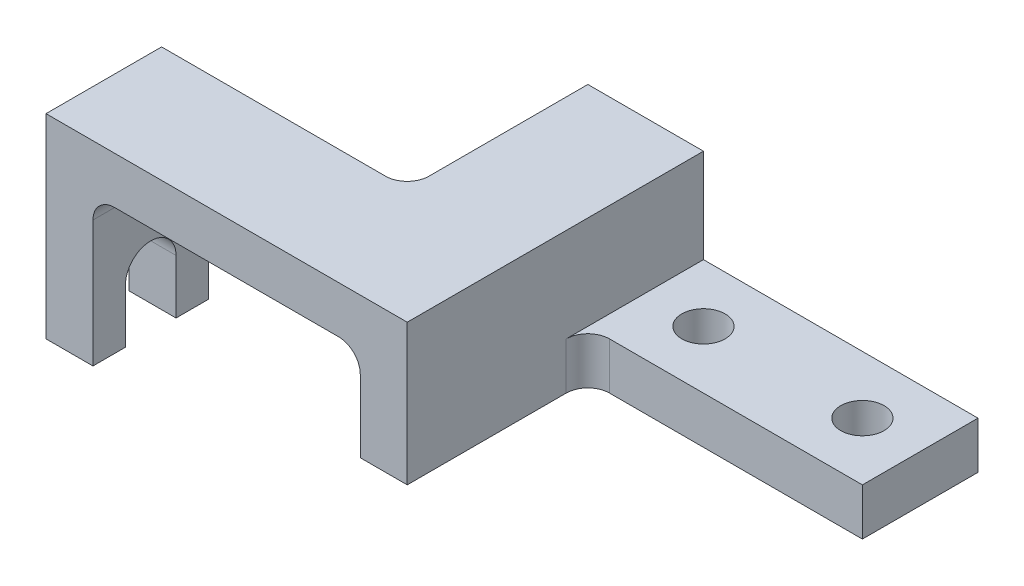
ISO-10303-21;
HEADER;
FILE_DESCRIPTION(('STEP AP214'),'2;1');
FILE_NAME('part.step','',(''),(''),'','','');
FILE_SCHEMA(('AUTOMOTIVE_DESIGN { 1 0 10303 214 1 1 1 1 }'));
ENDSEC;
DATA;
#1=APPLICATION_CONTEXT('core data for automotive mechanical design processes');
#2=APPLICATION_PROTOCOL_DEFINITION('international standard','automotive_design',2000,#1);
#3=PRODUCT_CONTEXT('',#1,'mechanical');
#4=PRODUCT('Part','Part','',(#3));
#5=PRODUCT_RELATED_PRODUCT_CATEGORY('part','',(#4));
#6=PRODUCT_DEFINITION_FORMATION('','',#4);
#7=PRODUCT_DEFINITION_CONTEXT('part definition',#1,'design');
#8=PRODUCT_DEFINITION('design','',#6,#7);
#9=PRODUCT_DEFINITION_SHAPE('','',#8);
#10=(LENGTH_UNIT() NAMED_UNIT(*) SI_UNIT(.MILLI.,.METRE.));
#11=(NAMED_UNIT(*) PLANE_ANGLE_UNIT() SI_UNIT($,.RADIAN.));
#12=(NAMED_UNIT(*) SI_UNIT($,.STERADIAN.) SOLID_ANGLE_UNIT());
#13=UNCERTAINTY_MEASURE_WITH_UNIT(LENGTH_MEASURE(1.E-05),#10,'distance_accuracy_value','');
#14=(GEOMETRIC_REPRESENTATION_CONTEXT(3) GLOBAL_UNCERTAINTY_ASSIGNED_CONTEXT((#13)) GLOBAL_UNIT_ASSIGNED_CONTEXT((#10,
#11,#12)) REPRESENTATION_CONTEXT('',''));
#15=CARTESIAN_POINT('',(0.,0.,0.));
#16=DIRECTION('',(0.,0.,1.));
#17=DIRECTION('',(1.,0.,0.));
#18=AXIS2_PLACEMENT_3D('',#15,#16,#17);
#19=CARTESIAN_POINT('',(0.,0.,0.));
#20=DIRECTION('',(0.,-1.,0.));
#21=DIRECTION('',(0.,0.,-1.));
#22=AXIS2_PLACEMENT_3D('',#19,#20,#21);
#23=PLANE('',#22);
#24=DIRECTION('',(0.,0.,1.));
#25=VECTOR('',#24,1.);
#26=CARTESIAN_POINT('',(0.,0.,0.));
#27=LINE('',#26,#25);
#28=CARTESIAN_POINT('',(0.,0.,-9.));
#29=VERTEX_POINT('',#28);
#30=CARTESIAN_POINT('',(0.,0.,0.));
#31=VERTEX_POINT('',#30);
#32=EDGE_CURVE('E335',#29,#31,#27,.T.);
#33=ORIENTED_EDGE('',*,*,#32,.F.);
#34=DIRECTION('',(-1.,0.,0.));
#35=VECTOR('',#34,1.);
#36=CARTESIAN_POINT('',(176.001,0.,-9.));
#37=LINE('',#36,#35);
#38=CARTESIAN_POINT('',(13.,0.,-8.99999999999999));
#39=VERTEX_POINT('',#38);
#40=EDGE_CURVE('E220',#39,#29,#37,.T.);
#41=ORIENTED_EDGE('',*,*,#40,.F.);
#42=DIRECTION('',(0.,0.,1.));
#43=VECTOR('',#42,1.);
#44=CARTESIAN_POINT('',(13.,0.,-82.));
#45=LINE('',#44,#43);
#46=CARTESIAN_POINT('',(13.,0.,0.));
#47=VERTEX_POINT('',#46);
#48=EDGE_CURVE('E268',#39,#47,#45,.T.);
#49=ORIENTED_EDGE('',*,*,#48,.T.);
#50=DIRECTION('',(1.,0.,0.));
#51=VECTOR('',#50,1.);
#52=CARTESIAN_POINT('',(0.,0.,0.));
#53=LINE('',#52,#51);
#54=EDGE_CURVE('E359',#31,#47,#53,.T.);
#55=ORIENTED_EDGE('',*,*,#54,.F.);
#56=EDGE_LOOP('',(#33,#41,#49,#55));
#57=FACE_BOUND('',#56,.T.);
#58=ADVANCED_FACE('F37',(#57),#23,.T.);
#59=CARTESIAN_POINT('',(13.,0.,-32.));
#60=VERTEX_POINT('',#59);
#61=CARTESIAN_POINT('',(13.,0.,-23.));
#62=VERTEX_POINT('',#61);
#63=EDGE_CURVE('E263',#60,#62,#45,.T.);
#64=ORIENTED_EDGE('',*,*,#63,.T.);
#65=DIRECTION('',(-1.,0.,0.));
#66=VECTOR('',#65,1.);
#67=CARTESIAN_POINT('',(176.001,0.,-23.));
#68=LINE('',#67,#66);
#69=CARTESIAN_POINT('',(0.,0.,-23.));
#70=VERTEX_POINT('',#69);
#71=EDGE_CURVE('E53',#62,#70,#68,.T.);
#72=ORIENTED_EDGE('',*,*,#71,.T.);
#73=CARTESIAN_POINT('',(0.,0.,-32.));
#74=VERTEX_POINT('',#73);
#75=EDGE_CURVE('E205',#74,#70,#27,.T.);
#76=ORIENTED_EDGE('',*,*,#75,.F.);
#77=DIRECTION('',(-1.,0.,0.));
#78=VECTOR('',#77,1.);
#79=CARTESIAN_POINT('',(0.,0.,-32.));
#80=LINE('',#79,#78);
#81=EDGE_CURVE('E341',#60,#74,#80,.T.);
#82=ORIENTED_EDGE('',*,*,#81,.F.);
#83=EDGE_LOOP('',(#64,#72,#76,#82));
#84=FACE_BOUND('',#83,.T.);
#85=ADVANCED_FACE('F437',(#84),#23,.T.);
#86=CARTESIAN_POINT('',(0.,54.,0.));
#87=DIRECTION('',(1.,0.,0.));
#88=DIRECTION('',(0.,0.,-1.));
#89=AXIS2_PLACEMENT_3D('',#86,#87,#88);
#90=PLANE('',#89);
#91=DIRECTION('',(0.,-1.,0.));
#92=VECTOR('',#91,1.);
#93=CARTESIAN_POINT('',(0.,15.,-9.));
#94=LINE('',#93,#92);
#95=CARTESIAN_POINT('',(0.,15.,-9.));
#96=VERTEX_POINT('',#95);
#97=EDGE_CURVE('E218',#96,#29,#94,.T.);
#98=ORIENTED_EDGE('',*,*,#97,.T.);
#99=ORIENTED_EDGE('',*,*,#32,.T.);
#100=DIRECTION('',(0.,-1.,0.));
#101=VECTOR('',#100,1.);
#102=CARTESIAN_POINT('',(0.,54.,0.));
#103=LINE('',#102,#101);
#104=CARTESIAN_POINT('',(0.,54.,0.));
#105=VERTEX_POINT('',#104);
#106=EDGE_CURVE('E382',#105,#31,#103,.T.);
#107=ORIENTED_EDGE('',*,*,#106,.F.);
#108=DIRECTION('',(0.,0.,1.));
#109=VECTOR('',#108,1.);
#110=CARTESIAN_POINT('',(0.,54.,0.));
#111=LINE('',#110,#109);
#112=CARTESIAN_POINT('',(0.,54.,-32.));
#113=VERTEX_POINT('',#112);
#114=EDGE_CURVE('E336',#113,#105,#111,.T.);
#115=ORIENTED_EDGE('',*,*,#114,.F.);
#116=DIRECTION('',(0.,-1.,0.));
#117=VECTOR('',#116,1.);
#118=CARTESIAN_POINT('',(0.,54.,-32.));
#119=LINE('',#118,#117);
#120=EDGE_CURVE('E356',#113,#74,#119,.T.);
#121=ORIENTED_EDGE('',*,*,#120,.T.);
#122=ORIENTED_EDGE('',*,*,#75,.T.);
#123=DIRECTION('',(0.,1.,0.));
#124=VECTOR('',#123,1.);
#125=CARTESIAN_POINT('',(0.,15.,-23.));
#126=LINE('',#125,#124);
#127=CARTESIAN_POINT('',(0.,15.,-23.));
#128=VERTEX_POINT('',#127);
#129=EDGE_CURVE('E183',#70,#128,#126,.T.);
#130=ORIENTED_EDGE('',*,*,#129,.T.);
#131=CARTESIAN_POINT('',(0.,15.,-16.));
#132=DIRECTION('',(1.,0.,0.));
#133=DIRECTION('',(0.,0.,-1.));
#134=AXIS2_PLACEMENT_3D('',#131,#132,#133);
#135=CIRCLE('',#134,7.);
#136=EDGE_CURVE('E188',#128,#96,#135,.T.);
#137=ORIENTED_EDGE('',*,*,#136,.T.);
#138=EDGE_LOOP('',(#98,#99,#107,#115,#121,#122,#130,#137));
#139=FACE_BOUND('',#138,.T.);
#140=ADVANCED_FACE('F202',(#139),#90,.F.);
#141=CARTESIAN_POINT('',(13.,35.,-82.));
#142=DIRECTION('',(-1.,0.,0.));
#143=DIRECTION('',(0.,0.,1.));
#144=AXIS2_PLACEMENT_3D('',#141,#142,#143);
#145=PLANE('',#144);
#146=DIRECTION('',(0.,1.,0.));
#147=VECTOR('',#146,1.);
#148=CARTESIAN_POINT('',(13.,15.,-9.));
#149=LINE('',#148,#147);
#150=CARTESIAN_POINT('',(13.,15.,-9.));
#151=VERTEX_POINT('',#150);
#152=EDGE_CURVE('E199',#39,#151,#149,.T.);
#153=ORIENTED_EDGE('',*,*,#152,.T.);
#154=CARTESIAN_POINT('',(13.,15.,-16.));
#155=DIRECTION('',(-1.,0.,0.));
#156=DIRECTION('',(0.,0.,1.));
#157=AXIS2_PLACEMENT_3D('',#154,#155,#156);
#158=CIRCLE('',#157,7.);
#159=CARTESIAN_POINT('',(13.,15.,-23.));
#160=VERTEX_POINT('',#159);
#161=EDGE_CURVE('E189',#151,#160,#158,.T.);
#162=ORIENTED_EDGE('',*,*,#161,.T.);
#163=DIRECTION('',(0.,-1.,0.));
#164=VECTOR('',#163,1.);
#165=CARTESIAN_POINT('',(13.,15.,-23.));
#166=LINE('',#165,#164);
#167=EDGE_CURVE('E184',#160,#62,#166,.T.);
#168=ORIENTED_EDGE('',*,*,#167,.T.);
#169=ORIENTED_EDGE('',*,*,#63,.F.);
#170=DIRECTION('',(0.,-1.,0.));
#171=VECTOR('',#170,1.);
#172=CARTESIAN_POINT('',(13.,54.,-32.));
#173=LINE('',#172,#171);
#174=CARTESIAN_POINT('',(13.,35.,-32.));
#175=VERTEX_POINT('',#174);
#176=EDGE_CURVE('E11',#175,#60,#173,.T.);
#177=ORIENTED_EDGE('',*,*,#176,.F.);
#178=DIRECTION('',(0.,0.,1.));
#179=VECTOR('',#178,1.);
#180=CARTESIAN_POINT('',(13.,35.,-82.));
#181=LINE('',#180,#179);
#182=CARTESIAN_POINT('',(13.,35.,0.));
#183=VERTEX_POINT('',#182);
#184=EDGE_CURVE('E269',#175,#183,#181,.T.);
#185=ORIENTED_EDGE('',*,*,#184,.T.);
#186=DIRECTION('',(0.,-1.,0.));
#187=VECTOR('',#186,1.);
#188=CARTESIAN_POINT('',(13.,35.,0.));
#189=LINE('',#188,#187);
#190=EDGE_CURVE('E232',#183,#47,#189,.T.);
#191=ORIENTED_EDGE('',*,*,#190,.T.);
#192=ORIENTED_EDGE('',*,*,#48,.F.);
#193=EDGE_LOOP('',(#153,#162,#168,#169,#177,#185,#191,#192));
#194=FACE_BOUND('',#193,.T.);
#195=ADVANCED_FACE('F435',(#194),#145,.F.);
#196=CARTESIAN_POINT('',(0.,54.,0.));
#197=DIRECTION('',(0.,-1.,0.));
#198=DIRECTION('',(0.,0.,-1.));
#199=AXIS2_PLACEMENT_3D('',#196,#197,#198);
#200=PLANE('',#199);
#201=DIRECTION('',(0.,0.,-1.));
#202=VECTOR('',#201,1.);
#203=CARTESIAN_POINT('',(100.,54.,0.));
#204=LINE('',#203,#202);
#205=CARTESIAN_POINT('',(100.,54.,0.));
#206=VERTEX_POINT('',#205);
#207=CARTESIAN_POINT('',(100.,54.,-82.));
#208=VERTEX_POINT('',#207);
#209=EDGE_CURVE('E344',#206,#208,#204,.T.);
#210=ORIENTED_EDGE('',*,*,#209,.T.);
#211=DIRECTION('',(-1.,0.,0.));
#212=VECTOR('',#211,1.);
#213=CARTESIAN_POINT('',(68.,54.,-82.));
#214=LINE('',#213,#212);
#215=CARTESIAN_POINT('',(68.,54.,-82.));
#216=VERTEX_POINT('',#215);
#217=EDGE_CURVE('E347',#208,#216,#214,.T.);
#218=ORIENTED_EDGE('',*,*,#217,.T.);
#219=DIRECTION('',(0.,0.,1.));
#220=VECTOR('',#219,1.);
#221=CARTESIAN_POINT('',(68.,54.,-32.));
#222=LINE('',#221,#220);
#223=CARTESIAN_POINT('',(68.,54.,-38.));
#224=VERTEX_POINT('',#223);
#225=EDGE_CURVE('E350',#216,#224,#222,.T.);
#226=ORIENTED_EDGE('',*,*,#225,.T.);
#227=CARTESIAN_POINT('',(62.,54.,-38.));
#228=DIRECTION('',(0.,-1.,0.));
#229=DIRECTION('',(0.,0.,-1.));
#230=AXIS2_PLACEMENT_3D('',#227,#228,#229);
#231=CIRCLE('',#230,6.);
#232=CARTESIAN_POINT('',(62.,54.,-32.));
#233=VERTEX_POINT('',#232);
#234=EDGE_CURVE('E401',#224,#233,#231,.T.);
#235=ORIENTED_EDGE('',*,*,#234,.T.);
#236=DIRECTION('',(-1.,0.,0.));
#237=VECTOR('',#236,1.);
#238=CARTESIAN_POINT('',(0.,54.,-32.));
#239=LINE('',#238,#237);
#240=EDGE_CURVE('E354',#233,#113,#239,.T.);
#241=ORIENTED_EDGE('',*,*,#240,.T.);
#242=ORIENTED_EDGE('',*,*,#114,.T.);
#243=DIRECTION('',(1.,0.,0.));
#244=VECTOR('',#243,1.);
#245=CARTESIAN_POINT('',(0.,54.,0.));
#246=LINE('',#245,#244);
#247=EDGE_CURVE('E340',#105,#206,#246,.T.);
#248=ORIENTED_EDGE('',*,*,#247,.T.);
#249=EDGE_LOOP('',(#210,#218,#226,#235,#241,#242,#248));
#250=FACE_BOUND('',#249,.T.);
#251=ADVANCED_FACE('F443',(#250),#200,.F.);
#252=CARTESIAN_POINT('',(0.,54.,0.));
#253=DIRECTION('',(0.,0.,-1.));
#254=DIRECTION('',(-1.,0.,0.));
#255=AXIS2_PLACEMENT_3D('',#252,#253,#254);
#256=PLANE('',#255);
#257=ORIENTED_EDGE('',*,*,#54,.T.);
#258=ORIENTED_EDGE('',*,*,#190,.F.);
#259=CARTESIAN_POINT('',(19.,35.,0.));
#260=DIRECTION('',(0.,0.,1.));
#261=DIRECTION('',(-1.,0.,0.));
#262=AXIS2_PLACEMENT_3D('',#259,#260,#261);
#263=CIRCLE('',#262,6.);
#264=CARTESIAN_POINT('',(19.,41.,0.));
#265=VERTEX_POINT('',#264);
#266=EDGE_CURVE('E256',#265,#183,#263,.T.);
#267=ORIENTED_EDGE('',*,*,#266,.F.);
#268=DIRECTION('',(-1.,0.,0.));
#269=VECTOR('',#268,1.);
#270=CARTESIAN_POINT('',(19.,41.,0.));
#271=LINE('',#270,#269);
#272=CARTESIAN_POINT('',(80.9999999999999,41.,0.));
#273=VERTEX_POINT('',#272);
#274=EDGE_CURVE('E252',#273,#265,#271,.T.);
#275=ORIENTED_EDGE('',*,*,#274,.F.);
#276=CARTESIAN_POINT('',(81.,35.,0.));
#277=DIRECTION('',(0.,0.,1.));
#278=DIRECTION('',(1.,0.,0.));
#279=AXIS2_PLACEMENT_3D('',#276,#277,#278);
#280=CIRCLE('',#279,6.);
#281=CARTESIAN_POINT('',(87.,35.,0.));
#282=VERTEX_POINT('',#281);
#283=EDGE_CURVE('E248',#282,#273,#280,.T.);
#284=ORIENTED_EDGE('',*,*,#283,.F.);
#285=DIRECTION('',(0.,1.,0.));
#286=VECTOR('',#285,1.);
#287=CARTESIAN_POINT('',(87.,35.,0.));
#288=LINE('',#287,#286);
#289=CARTESIAN_POINT('',(87.,15.,0.));
#290=VERTEX_POINT('',#289);
#291=EDGE_CURVE('E212',#290,#282,#288,.T.);
#292=ORIENTED_EDGE('',*,*,#291,.F.);
#293=DIRECTION('',(-1.,0.,0.));
#294=VECTOR('',#293,1.);
#295=CARTESIAN_POINT('',(87.,15.,0.));
#296=LINE('',#295,#294);
#297=CARTESIAN_POINT('',(100.,15.,0.));
#298=VERTEX_POINT('',#297);
#299=EDGE_CURVE('E207',#298,#290,#296,.T.);
#300=ORIENTED_EDGE('',*,*,#299,.F.);
#301=DIRECTION('',(0.,-1.,0.));
#302=VECTOR('',#301,1.);
#303=CARTESIAN_POINT('',(100.,54.,0.));
#304=LINE('',#303,#302);
#305=EDGE_CURVE('E379',#206,#298,#304,.T.);
#306=ORIENTED_EDGE('',*,*,#305,.F.);
#307=ORIENTED_EDGE('',*,*,#247,.F.);
#308=ORIENTED_EDGE('',*,*,#106,.T.);
#309=EDGE_LOOP('',(#257,#258,#267,#275,#284,#292,#300,#306,#307,#308));
#310=FACE_BOUND('',#309,.T.);
#311=ADVANCED_FACE('F431',(#310),#256,.F.);
#312=CARTESIAN_POINT('',(100.,54.,0.));
#313=DIRECTION('',(-1.,0.,0.));
#314=DIRECTION('',(0.,0.,1.));
#315=AXIS2_PLACEMENT_3D('',#312,#313,#314);
#316=PLANE('',#315);
#317=ORIENTED_EDGE('',*,*,#305,.T.);
#318=DIRECTION('',(0.,0.,-1.));
#319=VECTOR('',#318,1.);
#320=CARTESIAN_POINT('',(100.,15.,0.));
#321=LINE('',#320,#319);
#322=CARTESIAN_POINT('',(100.,15.,-44.));
#323=VERTEX_POINT('',#322);
#324=EDGE_CURVE('E323',#298,#323,#321,.T.);
#325=ORIENTED_EDGE('',*,*,#324,.T.);
#326=DIRECTION('',(0.,-1.,0.));
#327=VECTOR('',#326,1.);
#328=CARTESIAN_POINT('',(100.,54.,-44.));
#329=LINE('',#328,#327);
#330=CARTESIAN_POINT('',(100.,28.,-44.));
#331=VERTEX_POINT('',#330);
#332=EDGE_CURVE('E390',#323,#331,#329,.F.);
#333=ORIENTED_EDGE('',*,*,#332,.T.);
#334=DIRECTION('',(0.,0.,1.));
#335=VECTOR('',#334,1.);
#336=CARTESIAN_POINT('',(100.,28.,-82.));
#337=LINE('',#336,#335);
#338=CARTESIAN_POINT('',(100.,28.,-82.));
#339=VERTEX_POINT('',#338);
#340=EDGE_CURVE('E61',#339,#331,#337,.T.);
#341=ORIENTED_EDGE('',*,*,#340,.F.);
#342=DIRECTION('',(0.,-1.,0.));
#343=VECTOR('',#342,1.);
#344=CARTESIAN_POINT('',(100.,54.,-82.));
#345=LINE('',#344,#343);
#346=EDGE_CURVE('E267',#208,#339,#345,.T.);
#347=ORIENTED_EDGE('',*,*,#346,.F.);
#348=ORIENTED_EDGE('',*,*,#209,.F.);
#349=EDGE_LOOP('',(#317,#325,#333,#341,#347,#348));
#350=FACE_BOUND('',#349,.T.);
#351=ADVANCED_FACE('F470',(#350),#316,.F.);
#352=CARTESIAN_POINT('',(100.,54.,-50.));
#353=DIRECTION('',(0.,0.,-1.));
#354=DIRECTION('',(-1.,0.,0.));
#355=AXIS2_PLACEMENT_3D('',#352,#353,#354);
#356=PLANE('',#355);
#357=DIRECTION('',(0.,-1.,0.));
#358=VECTOR('',#357,1.);
#359=CARTESIAN_POINT('',(106.,0.,-50.));
#360=LINE('',#359,#358);
#361=CARTESIAN_POINT('',(106.,28.,-50.));
#362=VERTEX_POINT('',#361);
#363=CARTESIAN_POINT('',(106.,15.,-50.));
#364=VERTEX_POINT('',#363);
#365=EDGE_CURVE('E386',#362,#364,#360,.T.);
#366=ORIENTED_EDGE('',*,*,#365,.T.);
#367=DIRECTION('',(1.,0.,0.));
#368=VECTOR('',#367,1.);
#369=CARTESIAN_POINT('',(100.,15.,-50.));
#370=LINE('',#369,#368);
#371=CARTESIAN_POINT('',(176.,15.,-50.));
#372=VERTEX_POINT('',#371);
#373=EDGE_CURVE('E319',#364,#372,#370,.T.);
#374=ORIENTED_EDGE('',*,*,#373,.T.);
#375=DIRECTION('',(0.,-1.,0.));
#376=VECTOR('',#375,1.);
#377=CARTESIAN_POINT('',(176.,54.,-50.));
#378=LINE('',#377,#376);
#379=CARTESIAN_POINT('',(176.,28.,-50.));
#380=VERTEX_POINT('',#379);
#381=EDGE_CURVE('E375',#380,#372,#378,.T.);
#382=ORIENTED_EDGE('',*,*,#381,.F.);
#383=DIRECTION('',(-1.,0.,0.));
#384=VECTOR('',#383,1.);
#385=CARTESIAN_POINT('',(100.,28.,-50.));
#386=LINE('',#385,#384);
#387=EDGE_CURVE('E308',#380,#362,#386,.T.);
#388=ORIENTED_EDGE('',*,*,#387,.T.);
#389=EDGE_LOOP('',(#366,#374,#382,#388));
#390=FACE_BOUND('',#389,.T.);
#391=ADVANCED_FACE('F478',(#390),#356,.F.);
#392=CARTESIAN_POINT('',(176.,54.,-50.));
#393=DIRECTION('',(-1.,0.,0.));
#394=DIRECTION('',(0.,0.,1.));
#395=AXIS2_PLACEMENT_3D('',#392,#393,#394);
#396=PLANE('',#395);
#397=ORIENTED_EDGE('',*,*,#381,.T.);
#398=DIRECTION('',(0.,0.,1.));
#399=VECTOR('',#398,1.);
#400=CARTESIAN_POINT('',(176.,15.,-82.));
#401=LINE('',#400,#399);
#402=CARTESIAN_POINT('',(176.,15.,-82.));
#403=VERTEX_POINT('',#402);
#404=EDGE_CURVE('E243',#403,#372,#401,.T.);
#405=ORIENTED_EDGE('',*,*,#404,.F.);
#406=DIRECTION('',(0.,-1.,0.));
#407=VECTOR('',#406,1.);
#408=CARTESIAN_POINT('',(176.,54.,-82.));
#409=LINE('',#408,#407);
#410=CARTESIAN_POINT('',(176.,28.,-82.));
#411=VERTEX_POINT('',#410);
#412=EDGE_CURVE('E371',#411,#403,#409,.T.);
#413=ORIENTED_EDGE('',*,*,#412,.F.);
#414=DIRECTION('',(0.,0.,1.));
#415=VECTOR('',#414,1.);
#416=CARTESIAN_POINT('',(176.,28.,-82.));
#417=LINE('',#416,#415);
#418=EDGE_CURVE('E294',#411,#380,#417,.T.);
#419=ORIENTED_EDGE('',*,*,#418,.T.);
#420=EDGE_LOOP('',(#397,#405,#413,#419));
#421=FACE_BOUND('',#420,.T.);
#422=ADVANCED_FACE('F480',(#421),#396,.F.);
#423=CARTESIAN_POINT('',(68.,54.,-82.));
#424=DIRECTION('',(0.,0.,1.));
#425=DIRECTION('',(1.,0.,0.));
#426=AXIS2_PLACEMENT_3D('',#423,#424,#425);
#427=PLANE('',#426);
#428=CARTESIAN_POINT('',(81.,35.,-82.));
#429=DIRECTION('',(0.,0.,1.));
#430=DIRECTION('',(1.,0.,0.));
#431=AXIS2_PLACEMENT_3D('',#428,#429,#430);
#432=CIRCLE('',#431,6.);
#433=CARTESIAN_POINT('',(87.,35.,-82.));
#434=VERTEX_POINT('',#433);
#435=CARTESIAN_POINT('',(80.9999999999999,41.,-82.));
#436=VERTEX_POINT('',#435);
#437=EDGE_CURVE('E236',#434,#436,#432,.T.);
#438=ORIENTED_EDGE('',*,*,#437,.T.);
#439=DIRECTION('',(-1.,0.,0.));
#440=VECTOR('',#439,1.);
#441=CARTESIAN_POINT('',(19.,41.,-82.));
#442=LINE('',#441,#440);
#443=CARTESIAN_POINT('',(68.,41.,-82.));
#444=VERTEX_POINT('',#443);
#445=EDGE_CURVE('E240',#436,#444,#442,.T.);
#446=ORIENTED_EDGE('',*,*,#445,.T.);
#447=DIRECTION('',(0.,-1.,0.));
#448=VECTOR('',#447,1.);
#449=CARTESIAN_POINT('',(68.,54.,-82.));
#450=LINE('',#449,#448);
#451=EDGE_CURVE('E367',#216,#444,#450,.T.);
#452=ORIENTED_EDGE('',*,*,#451,.F.);
#453=ORIENTED_EDGE('',*,*,#217,.F.);
#454=ORIENTED_EDGE('',*,*,#346,.T.);
#455=DIRECTION('',(1.,0.,0.));
#456=VECTOR('',#455,1.);
#457=CARTESIAN_POINT('',(100.,28.,-82.));
#458=LINE('',#457,#456);
#459=EDGE_CURVE('E290',#339,#411,#458,.T.);
#460=ORIENTED_EDGE('',*,*,#459,.T.);
#461=ORIENTED_EDGE('',*,*,#412,.T.);
#462=DIRECTION('',(-1.,0.,0.));
#463=VECTOR('',#462,1.);
#464=CARTESIAN_POINT('',(87.,15.,-82.));
#465=LINE('',#464,#463);
#466=CARTESIAN_POINT('',(87.,15.,-82.));
#467=VERTEX_POINT('',#466);
#468=EDGE_CURVE('E227',#403,#467,#465,.T.);
#469=ORIENTED_EDGE('',*,*,#468,.T.);
#470=DIRECTION('',(0.,1.,0.));
#471=VECTOR('',#470,1.);
#472=CARTESIAN_POINT('',(87.,35.,-82.));
#473=LINE('',#472,#471);
#474=EDGE_CURVE('E231',#467,#434,#473,.T.);
#475=ORIENTED_EDGE('',*,*,#474,.T.);
#476=EDGE_LOOP('',(#438,#446,#452,#453,#454,#460,#461,#469,#475));
#477=FACE_BOUND('',#476,.T.);
#478=ADVANCED_FACE('F455',(#477),#427,.F.);
#479=CARTESIAN_POINT('',(68.,54.,-32.));
#480=DIRECTION('',(1.,0.,0.));
#481=DIRECTION('',(0.,0.,-1.));
#482=AXIS2_PLACEMENT_3D('',#479,#480,#481);
#483=PLANE('',#482);
#484=ORIENTED_EDGE('',*,*,#451,.T.);
#485=DIRECTION('',(0.,0.,1.));
#486=VECTOR('',#485,1.);
#487=CARTESIAN_POINT('',(68.,41.,-32.));
#488=LINE('',#487,#486);
#489=CARTESIAN_POINT('',(68.,41.,-38.));
#490=VERTEX_POINT('',#489);
#491=EDGE_CURVE('E304',#444,#490,#488,.T.);
#492=ORIENTED_EDGE('',*,*,#491,.T.);
#493=DIRECTION('',(0.,-1.,0.));
#494=VECTOR('',#493,1.);
#495=CARTESIAN_POINT('',(68.,54.,-38.));
#496=LINE('',#495,#494);
#497=EDGE_CURVE('E398',#490,#224,#496,.F.);
#498=ORIENTED_EDGE('',*,*,#497,.T.);
#499=ORIENTED_EDGE('',*,*,#225,.F.);
#500=EDGE_LOOP('',(#484,#492,#498,#499));
#501=FACE_BOUND('',#500,.T.);
#502=ADVANCED_FACE('F450',(#501),#483,.F.);
#503=CARTESIAN_POINT('',(0.,54.,-32.));
#504=DIRECTION('',(0.,0.,1.));
#505=DIRECTION('',(1.,0.,0.));
#506=AXIS2_PLACEMENT_3D('',#503,#504,#505);
#507=PLANE('',#506);
#508=CARTESIAN_POINT('',(19.,35.,-32.));
#509=DIRECTION('',(0.,0.,1.));
#510=DIRECTION('',(1.,0.,0.));
#511=AXIS2_PLACEMENT_3D('',#508,#509,#510);
#512=CIRCLE('',#511,6.);
#513=CARTESIAN_POINT('',(19.,41.,-32.));
#514=VERTEX_POINT('',#513);
#515=EDGE_CURVE('E46',#514,#175,#512,.T.);
#516=ORIENTED_EDGE('',*,*,#515,.T.);
#517=ORIENTED_EDGE('',*,*,#176,.T.);
#518=ORIENTED_EDGE('',*,*,#81,.T.);
#519=ORIENTED_EDGE('',*,*,#120,.F.);
#520=ORIENTED_EDGE('',*,*,#240,.F.);
#521=DIRECTION('',(0.,-1.,0.));
#522=VECTOR('',#521,1.);
#523=CARTESIAN_POINT('',(62.,0.,-32.));
#524=LINE('',#523,#522);
#525=CARTESIAN_POINT('',(62.,41.,-32.));
#526=VERTEX_POINT('',#525);
#527=EDGE_CURVE('E394',#233,#526,#524,.T.);
#528=ORIENTED_EDGE('',*,*,#527,.T.);
#529=DIRECTION('',(-1.,0.,0.));
#530=VECTOR('',#529,1.);
#531=CARTESIAN_POINT('',(0.,41.,-32.));
#532=LINE('',#531,#530);
#533=EDGE_CURVE('E298',#526,#514,#532,.T.);
#534=ORIENTED_EDGE('',*,*,#533,.T.);
#535=EDGE_LOOP('',(#516,#517,#518,#519,#520,#528,#534));
#536=FACE_BOUND('',#535,.T.);
#537=ADVANCED_FACE('F417',(#536),#507,.F.);
#538=CARTESIAN_POINT('',(106.,54.,-44.));
#539=DIRECTION('',(0.,1.,0.));
#540=DIRECTION('',(0.,0.,1.));
#541=AXIS2_PLACEMENT_3D('',#538,#539,#540);
#542=CYLINDRICAL_SURFACE('',#541,6.);
#543=ORIENTED_EDGE('',*,*,#332,.F.);
#544=CARTESIAN_POINT('',(106.,15.,-44.));
#545=DIRECTION('',(0.,1.,0.));
#546=DIRECTION('',(0.,0.,1.));
#547=AXIS2_PLACEMENT_3D('',#544,#545,#546);
#548=CIRCLE('',#547,6.);
#549=EDGE_CURVE('E411',#323,#364,#548,.F.);
#550=ORIENTED_EDGE('',*,*,#549,.T.);
#551=ORIENTED_EDGE('',*,*,#365,.F.);
#552=CARTESIAN_POINT('',(106.,28.,-44.));
#553=DIRECTION('',(0.,-1.,0.));
#554=DIRECTION('',(0.,0.,-1.));
#555=AXIS2_PLACEMENT_3D('',#552,#553,#554);
#556=CIRCLE('',#555,6.);
#557=EDGE_CURVE('E408',#362,#331,#556,.F.);
#558=ORIENTED_EDGE('',*,*,#557,.T.);
#559=EDGE_LOOP('',(#543,#550,#551,#558));
#560=FACE_BOUND('',#559,.T.);
#561=ADVANCED_FACE('F473',(#560),#542,.F.);
#562=CARTESIAN_POINT('',(62.,54.,-38.));
#563=DIRECTION('',(0.,1.,0.));
#564=DIRECTION('',(0.,0.,1.));
#565=AXIS2_PLACEMENT_3D('',#562,#563,#564);
#566=CYLINDRICAL_SURFACE('',#565,6.);
#567=ORIENTED_EDGE('',*,*,#497,.F.);
#568=CARTESIAN_POINT('',(62.,41.,-38.));
#569=DIRECTION('',(0.,1.,0.));
#570=DIRECTION('',(0.,0.,1.));
#571=AXIS2_PLACEMENT_3D('',#568,#569,#570);
#572=CIRCLE('',#571,6.);
#573=EDGE_CURVE('E404',#490,#526,#572,.F.);
#574=ORIENTED_EDGE('',*,*,#573,.T.);
#575=ORIENTED_EDGE('',*,*,#527,.F.);
#576=ORIENTED_EDGE('',*,*,#234,.F.);
#577=EDGE_LOOP('',(#567,#574,#575,#576));
#578=FACE_BOUND('',#577,.T.);
#579=ADVANCED_FACE('F39',(#578),#566,.F.);
#580=CARTESIAN_POINT('',(19.,35.,-82.));
#581=DIRECTION('',(0.,0.,1.));
#582=DIRECTION('',(1.,0.,0.));
#583=AXIS2_PLACEMENT_3D('',#580,#581,#582);
#584=CYLINDRICAL_SURFACE('',#583,6.);
#585=DIRECTION('',(0.,0.,1.));
#586=VECTOR('',#585,1.);
#587=CARTESIAN_POINT('',(19.,41.,-82.));
#588=LINE('',#587,#586);
#589=EDGE_CURVE('E272',#514,#265,#588,.T.);
#590=ORIENTED_EDGE('',*,*,#589,.T.);
#591=ORIENTED_EDGE('',*,*,#266,.T.);
#592=ORIENTED_EDGE('',*,*,#184,.F.);
#593=ORIENTED_EDGE('',*,*,#515,.F.);
#594=EDGE_LOOP('',(#590,#591,#592,#593));
#595=FACE_BOUND('',#594,.T.);
#596=ADVANCED_FACE('F422',(#595),#584,.F.);
#597=CARTESIAN_POINT('',(87.,15.,-82.));
#598=DIRECTION('',(0.,1.,0.));
#599=DIRECTION('',(0.,0.,1.));
#600=AXIS2_PLACEMENT_3D('',#597,#598,#599);
#601=PLANE('',#600);
#602=CARTESIAN_POINT('',(116.,15.,-66.));
#603=DIRECTION('',(0.,1.,0.));
#604=DIRECTION('',(0.,0.,1.));
#605=AXIS2_PLACEMENT_3D('',#602,#603,#604);
#606=CIRCLE('',#605,6.);
#607=CARTESIAN_POINT('',(116.,15.,-60.));
#608=VERTEX_POINT('',#607);
#609=EDGE_CURVE('E331',#608,#608,#606,.T.);
#610=ORIENTED_EDGE('',*,*,#609,.T.);
#611=EDGE_LOOP('',(#610));
#612=FACE_BOUND('',#611,.T.);
#613=CARTESIAN_POINT('',(160.,15.,-66.));
#614=DIRECTION('',(0.,1.,0.));
#615=DIRECTION('',(0.,0.,1.));
#616=AXIS2_PLACEMENT_3D('',#613,#614,#615);
#617=CIRCLE('',#616,6.00000000000002);
#618=CARTESIAN_POINT('',(160.,15.,-60.));
#619=VERTEX_POINT('',#618);
#620=EDGE_CURVE('E327',#619,#619,#617,.T.);
#621=ORIENTED_EDGE('',*,*,#620,.T.);
#622=EDGE_LOOP('',(#621));
#623=FACE_BOUND('',#622,.T.);
#624=ORIENTED_EDGE('',*,*,#299,.T.);
#625=DIRECTION('',(0.,0.,1.));
#626=VECTOR('',#625,1.);
#627=CARTESIAN_POINT('',(87.,15.,-82.));
#628=LINE('',#627,#626);
#629=EDGE_CURVE('E281',#467,#290,#628,.T.);
#630=ORIENTED_EDGE('',*,*,#629,.F.);
#631=ORIENTED_EDGE('',*,*,#468,.F.);
#632=ORIENTED_EDGE('',*,*,#404,.T.);
#633=ORIENTED_EDGE('',*,*,#373,.F.);
#634=ORIENTED_EDGE('',*,*,#549,.F.);
#635=ORIENTED_EDGE('',*,*,#324,.F.);
#636=EDGE_LOOP('',(#624,#630,#631,#632,#633,#634,#635));
#637=FACE_BOUND('',#636,.T.);
#638=ADVANCED_FACE('F465',(#612,#623,#637),#601,.F.);
#639=CARTESIAN_POINT('',(19.,41.,-82.));
#640=DIRECTION('',(0.,1.,0.));
#641=DIRECTION('',(0.,0.,1.));
#642=AXIS2_PLACEMENT_3D('',#639,#640,#641);
#643=PLANE('',#642);
#644=ORIENTED_EDGE('',*,*,#445,.F.);
#645=DIRECTION('',(0.,0.,1.));
#646=VECTOR('',#645,1.);
#647=CARTESIAN_POINT('',(80.9999999999999,41.,-82.));
#648=LINE('',#647,#646);
#649=EDGE_CURVE('E275',#436,#273,#648,.T.);
#650=ORIENTED_EDGE('',*,*,#649,.T.);
#651=ORIENTED_EDGE('',*,*,#274,.T.);
#652=ORIENTED_EDGE('',*,*,#589,.F.);
#653=ORIENTED_EDGE('',*,*,#533,.F.);
#654=ORIENTED_EDGE('',*,*,#573,.F.);
#655=ORIENTED_EDGE('',*,*,#491,.F.);
#656=EDGE_LOOP('',(#644,#650,#651,#652,#653,#654,#655));
#657=FACE_BOUND('',#656,.T.);
#658=ADVANCED_FACE('F425',(#657),#643,.F.);
#659=CARTESIAN_POINT('',(81.,35.,-82.));
#660=DIRECTION('',(0.,0.,1.));
#661=DIRECTION('',(1.,0.,0.));
#662=AXIS2_PLACEMENT_3D('',#659,#660,#661);
#663=CYLINDRICAL_SURFACE('',#662,6.);
#664=ORIENTED_EDGE('',*,*,#283,.T.);
#665=ORIENTED_EDGE('',*,*,#649,.F.);
#666=ORIENTED_EDGE('',*,*,#437,.F.);
#667=DIRECTION('',(0.,0.,1.));
#668=VECTOR('',#667,1.);
#669=CARTESIAN_POINT('',(87.,35.,-82.));
#670=LINE('',#669,#668);
#671=EDGE_CURVE('E278',#434,#282,#670,.T.);
#672=ORIENTED_EDGE('',*,*,#671,.T.);
#673=EDGE_LOOP('',(#664,#665,#666,#672));
#674=FACE_BOUND('',#673,.T.);
#675=ADVANCED_FACE('F459',(#674),#663,.F.);
#676=CARTESIAN_POINT('',(87.,35.,-82.));
#677=DIRECTION('',(1.,0.,0.));
#678=DIRECTION('',(0.,0.,-1.));
#679=AXIS2_PLACEMENT_3D('',#676,#677,#678);
#680=PLANE('',#679);
#681=ORIENTED_EDGE('',*,*,#291,.T.);
#682=ORIENTED_EDGE('',*,*,#671,.F.);
#683=ORIENTED_EDGE('',*,*,#474,.F.);
#684=ORIENTED_EDGE('',*,*,#629,.T.);
#685=EDGE_LOOP('',(#681,#682,#683,#684));
#686=FACE_BOUND('',#685,.T.);
#687=ADVANCED_FACE('F463',(#686),#680,.F.);
#688=CARTESIAN_POINT('',(100.,28.,-82.));
#689=DIRECTION('',(0.,-1.,0.));
#690=DIRECTION('',(0.,0.,-1.));
#691=AXIS2_PLACEMENT_3D('',#688,#689,#690);
#692=PLANE('',#691);
#693=CARTESIAN_POINT('',(116.,28.,-66.));
#694=DIRECTION('',(0.,-1.,0.));
#695=DIRECTION('',(0.,0.,-1.));
#696=AXIS2_PLACEMENT_3D('',#693,#694,#695);
#697=CIRCLE('',#696,6.);
#698=CARTESIAN_POINT('',(116.,28.,-72.));
#699=VERTEX_POINT('',#698);
#700=EDGE_CURVE('E315',#699,#699,#697,.T.);
#701=ORIENTED_EDGE('',*,*,#700,.T.);
#702=EDGE_LOOP('',(#701));
#703=FACE_BOUND('',#702,.T.);
#704=CARTESIAN_POINT('',(160.,28.,-66.));
#705=DIRECTION('',(0.,-1.,0.));
#706=DIRECTION('',(0.,0.,-1.));
#707=AXIS2_PLACEMENT_3D('',#704,#705,#706);
#708=CIRCLE('',#707,6.00000000000002);
#709=CARTESIAN_POINT('',(160.,28.,-72.));
#710=VERTEX_POINT('',#709);
#711=EDGE_CURVE('E312',#710,#710,#708,.T.);
#712=ORIENTED_EDGE('',*,*,#711,.T.);
#713=EDGE_LOOP('',(#712));
#714=FACE_BOUND('',#713,.T.);
#715=ORIENTED_EDGE('',*,*,#418,.F.);
#716=ORIENTED_EDGE('',*,*,#459,.F.);
#717=ORIENTED_EDGE('',*,*,#340,.T.);
#718=ORIENTED_EDGE('',*,*,#557,.F.);
#719=ORIENTED_EDGE('',*,*,#387,.F.);
#720=EDGE_LOOP('',(#715,#716,#717,#718,#719));
#721=FACE_BOUND('',#720,.T.);
#722=ADVANCED_FACE('F475',(#703,#714,#721),#692,.F.);
#723=CARTESIAN_POINT('',(160.,54.,-66.));
#724=DIRECTION('',(0.,-1.,0.));
#725=DIRECTION('',(0.,0.,-1.));
#726=AXIS2_PLACEMENT_3D('',#723,#724,#725);
#727=CYLINDRICAL_SURFACE('',#726,6.00000000000002);
#728=ORIENTED_EDGE('',*,*,#620,.F.);
#729=EDGE_LOOP('',(#728));
#730=FACE_BOUND('',#729,.T.);
#731=ORIENTED_EDGE('',*,*,#711,.F.);
#732=EDGE_LOOP('',(#731));
#733=FACE_BOUND('',#732,.T.);
#734=ADVANCED_FACE('F550',(#730,#733),#727,.F.);
#735=CARTESIAN_POINT('',(116.,54.,-66.));
#736=DIRECTION('',(0.,-1.,0.));
#737=DIRECTION('',(0.,0.,-1.));
#738=AXIS2_PLACEMENT_3D('',#735,#736,#737);
#739=CYLINDRICAL_SURFACE('',#738,6.);
#740=ORIENTED_EDGE('',*,*,#609,.F.);
#741=EDGE_LOOP('',(#740));
#742=FACE_BOUND('',#741,.T.);
#743=ORIENTED_EDGE('',*,*,#700,.F.);
#744=EDGE_LOOP('',(#743));
#745=FACE_BOUND('',#744,.T.);
#746=ADVANCED_FACE('F557',(#742,#745),#739,.F.);
#747=CARTESIAN_POINT('',(176.001,15.,-16.));
#748=DIRECTION('',(-1.,0.,0.));
#749=DIRECTION('',(0.,0.,1.));
#750=AXIS2_PLACEMENT_3D('',#747,#748,#749);
#751=CYLINDRICAL_SURFACE('',#750,7.);
#752=DIRECTION('',(-1.,0.,0.));
#753=VECTOR('',#752,1.);
#754=CARTESIAN_POINT('',(176.001,15.,-9.));
#755=LINE('',#754,#753);
#756=EDGE_CURVE('E194',#151,#96,#755,.T.);
#757=ORIENTED_EDGE('',*,*,#756,.T.);
#758=ORIENTED_EDGE('',*,*,#136,.F.);
#759=DIRECTION('',(-1.,0.,0.));
#760=VECTOR('',#759,1.);
#761=CARTESIAN_POINT('',(176.001,15.,-23.));
#762=LINE('',#761,#760);
#763=EDGE_CURVE('E179',#160,#128,#762,.T.);
#764=ORIENTED_EDGE('',*,*,#763,.F.);
#765=ORIENTED_EDGE('',*,*,#161,.F.);
#766=EDGE_LOOP('',(#757,#758,#764,#765));
#767=FACE_BOUND('',#766,.T.);
#768=ADVANCED_FACE('F192',(#767),#751,.F.);
#769=CARTESIAN_POINT('',(176.001,15.,-9.));
#770=DIRECTION('',(0.,0.,-1.));
#771=DIRECTION('',(-1.,0.,0.));
#772=AXIS2_PLACEMENT_3D('',#769,#770,#771);
#773=PLANE('',#772);
#774=ORIENTED_EDGE('',*,*,#40,.T.);
#775=ORIENTED_EDGE('',*,*,#97,.F.);
#776=ORIENTED_EDGE('',*,*,#756,.F.);
#777=ORIENTED_EDGE('',*,*,#152,.F.);
#778=EDGE_LOOP('',(#774,#775,#776,#777));
#779=FACE_BOUND('',#778,.T.);
#780=ADVANCED_FACE('F569',(#779),#773,.T.);
#781=CARTESIAN_POINT('',(176.001,15.,-23.));
#782=DIRECTION('',(0.,0.,1.));
#783=DIRECTION('',(1.,0.,0.));
#784=AXIS2_PLACEMENT_3D('',#781,#782,#783);
#785=PLANE('',#784);
#786=ORIENTED_EDGE('',*,*,#763,.T.);
#787=ORIENTED_EDGE('',*,*,#129,.F.);
#788=ORIENTED_EDGE('',*,*,#71,.F.);
#789=ORIENTED_EDGE('',*,*,#167,.F.);
#790=EDGE_LOOP('',(#786,#787,#788,#789));
#791=FACE_BOUND('',#790,.T.);
#792=ADVANCED_FACE('F181',(#791),#785,.T.);
#793=CLOSED_SHELL('',(#58,#85,#140,#195,#251,#311,#351,#391,#422,#478,#502,#537,#561,#579,#596,
#638,#658,#675,#687,#722,#734,#746,#768,#780,#792));
#794=MANIFOLD_SOLID_BREP('B2',#793);
#795=ADVANCED_BREP_SHAPE_REPRESENTATION('',(#18,#794),#14);
#796=SHAPE_DEFINITION_REPRESENTATION(#9,#795);
ENDSEC;
END-ISO-10303-21;
